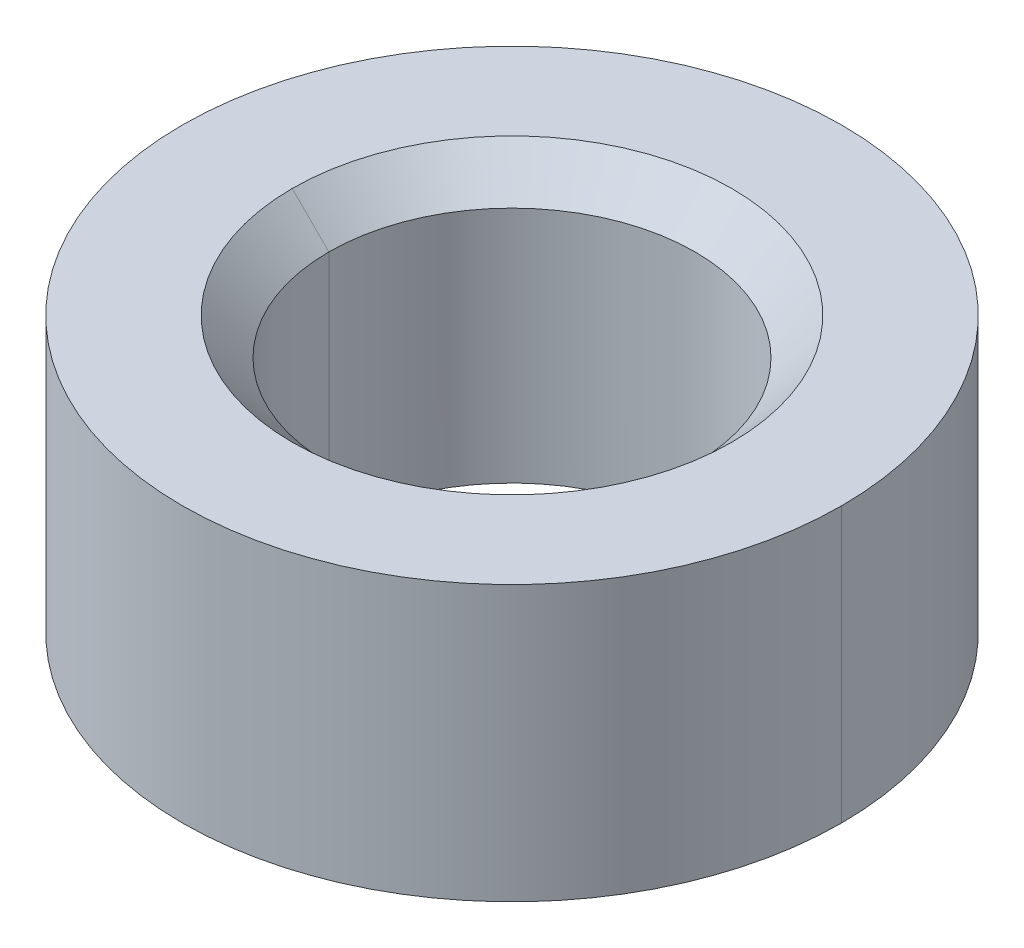
ISO-10303-21;
HEADER;
FILE_DESCRIPTION(('STEP AP214'),'2;1');
FILE_NAME('part.step','',(''),(''),'','','');
FILE_SCHEMA(('AUTOMOTIVE_DESIGN { 1 0 10303 214 1 1 1 1 }'));
ENDSEC;
DATA;
#1=APPLICATION_CONTEXT('core data for automotive mechanical design processes');
#2=APPLICATION_PROTOCOL_DEFINITION('international standard','automotive_design',2000,#1);
#3=PRODUCT_CONTEXT('',#1,'mechanical');
#4=PRODUCT('Part','Part','',(#3));
#5=PRODUCT_RELATED_PRODUCT_CATEGORY('part','',(#4));
#6=PRODUCT_DEFINITION_FORMATION('','',#4);
#7=PRODUCT_DEFINITION_CONTEXT('part definition',#1,'design');
#8=PRODUCT_DEFINITION('design','',#6,#7);
#9=PRODUCT_DEFINITION_SHAPE('','',#8);
#10=(LENGTH_UNIT() NAMED_UNIT(*) SI_UNIT(.MILLI.,.METRE.));
#11=(NAMED_UNIT(*) PLANE_ANGLE_UNIT() SI_UNIT($,.RADIAN.));
#12=(NAMED_UNIT(*) SI_UNIT($,.STERADIAN.) SOLID_ANGLE_UNIT());
#13=UNCERTAINTY_MEASURE_WITH_UNIT(LENGTH_MEASURE(1.E-05),#10,'distance_accuracy_value','');
#14=(GEOMETRIC_REPRESENTATION_CONTEXT(3) GLOBAL_UNCERTAINTY_ASSIGNED_CONTEXT((#13)) GLOBAL_UNIT_ASSIGNED_CONTEXT((#10,
#11,#12)) REPRESENTATION_CONTEXT('',''));
#15=CARTESIAN_POINT('',(0.,0.,0.));
#16=DIRECTION('',(0.,0.,1.));
#17=DIRECTION('',(1.,0.,0.));
#18=AXIS2_PLACEMENT_3D('',#15,#16,#17);
#19=CARTESIAN_POINT('',(0.,0.,0.));
#20=DIRECTION('',(0.,1.,0.));
#21=DIRECTION('',(-1.,0.,0.));
#22=AXIS2_PLACEMENT_3D('',#19,#20,#21);
#23=CYLINDRICAL_SURFACE('',#22,1.);
#24=DIRECTION('',(0.,1.,1.358610737866E-10));
#25=VECTOR('',#24,1.);
#26=CARTESIAN_POINT('',(-1.,-1.5,0.));
#27=LINE('',#26,#25);
#28=CARTESIAN_POINT('',(-1.,-1.5,0.));
#29=VERTEX_POINT('',#28);
#30=CARTESIAN_POINT('',(-1.,-0.1999999999999,0.));
#31=VERTEX_POINT('',#30);
#32=EDGE_CURVE('E141',#29,#31,#27,.T.);
#33=ORIENTED_EDGE('',*,*,#32,.F.);
#34=CARTESIAN_POINT('',(0.,-1.5,0.));
#35=DIRECTION('',(0.,-1.,0.));
#36=DIRECTION('',(-1.,0.,0.));
#37=AXIS2_PLACEMENT_3D('',#34,#35,#36);
#38=CIRCLE('',#37,1.);
#39=CARTESIAN_POINT('',(1.,-1.5,0.));
#40=VERTEX_POINT('',#39);
#41=EDGE_CURVE('E155',#29,#40,#38,.T.);
#42=ORIENTED_EDGE('',*,*,#41,.T.);
#43=DIRECTION('',(0.,1.,-1.166739148025E-10));
#44=VECTOR('',#43,1.);
#45=CARTESIAN_POINT('',(1.,-1.5,-9.97722365513E-11));
#46=LINE('',#45,#44);
#47=CARTESIAN_POINT('',(1.,-0.1999999999999,-1.49658385344E-10));
#48=VERTEX_POINT('',#47);
#49=EDGE_CURVE('E145',#40,#48,#46,.T.);
#50=ORIENTED_EDGE('',*,*,#49,.T.);
#51=CARTESIAN_POINT('',(0.,-0.1999999999999,0.));
#52=DIRECTION('',(0.,1.,0.));
#53=DIRECTION('',(1.,0.,-1.49658385344E-10));
#54=AXIS2_PLACEMENT_3D('',#51,#52,#53);
#55=CIRCLE('',#54,1.);
#56=CARTESIAN_POINT('',(0.,-0.1999999999999,-1.));
#57=VERTEX_POINT('',#56);
#58=EDGE_CURVE('E11',#48,#57,#55,.T.);
#59=ORIENTED_EDGE('',*,*,#58,.T.);
#60=CARTESIAN_POINT('',(0.,-0.1999999999999,0.));
#61=DIRECTION('',(0.,1.,0.));
#62=DIRECTION('',(0.,0.,-1.));
#63=AXIS2_PLACEMENT_3D('',#60,#61,#62);
#64=CIRCLE('',#63,1.);
#65=EDGE_CURVE('E27',#57,#31,#64,.T.);
#66=ORIENTED_EDGE('',*,*,#65,.T.);
#67=EDGE_LOOP('',(#33,#42,#50,#59,#66));
#68=FACE_BOUND('',#67,.T.);
#69=ADVANCED_FACE('F17',(#68),#23,.F.);
#70=CARTESIAN_POINT('',(0.,-0.09999999999995,0.));
#71=DIRECTION('',(0.,1.,0.));
#72=DIRECTION('',(0.,0.,-1.));
#73=AXIS2_PLACEMENT_3D('',#70,#71,#72);
#74=CONICAL_SURFACE('',#73,1.1,0.7853981633973);
#75=DIRECTION('',(-0.707106781186498,0.707106781186598,3.74666534267698E-10));
#76=VECTOR('',#75,1.);
#77=CARTESIAN_POINT('',(-1.,-0.2,1.766192939348E-10));
#78=LINE('',#77,#76);
#79=CARTESIAN_POINT('',(-1.2,0.,0.));
#80=VERTEX_POINT('',#79);
#81=EDGE_CURVE('E111',#31,#80,#78,.T.);
#82=ORIENTED_EDGE('',*,*,#81,.F.);
#83=ORIENTED_EDGE('',*,*,#65,.F.);
#84=ORIENTED_EDGE('',*,*,#58,.F.);
#85=DIRECTION('',(0.707106781186498,0.707106781186598,-1.101046989055E-10));
#86=VECTOR('',#85,1.);
#87=CARTESIAN_POINT('',(1.,-0.2,-2.514483257945E-10));
#88=LINE('',#87,#86);
#89=CARTESIAN_POINT('',(1.2,0.,0.));
#90=VERTEX_POINT('',#89);
#91=EDGE_CURVE('E100',#48,#90,#88,.T.);
#92=ORIENTED_EDGE('',*,*,#91,.T.);
#93=CARTESIAN_POINT('',(0.,0.,0.));
#94=DIRECTION('',(0.,1.,0.));
#95=DIRECTION('',(1.,0.,0.));
#96=AXIS2_PLACEMENT_3D('',#93,#94,#95);
#97=CIRCLE('',#96,1.2);
#98=CARTESIAN_POINT('',(0.,0.,-1.2));
#99=VERTEX_POINT('',#98);
#100=EDGE_CURVE('E105',#90,#99,#97,.T.);
#101=ORIENTED_EDGE('',*,*,#100,.T.);
#102=CARTESIAN_POINT('',(0.,0.,0.));
#103=DIRECTION('',(0.,1.,0.));
#104=DIRECTION('',(0.,0.,-1.));
#105=AXIS2_PLACEMENT_3D('',#102,#103,#104);
#106=CIRCLE('',#105,1.2);
#107=EDGE_CURVE('E119',#99,#80,#106,.T.);
#108=ORIENTED_EDGE('',*,*,#107,.T.);
#109=EDGE_LOOP('',(#82,#83,#84,#92,#101,#108));
#110=FACE_BOUND('',#109,.T.);
#111=ADVANCED_FACE('F103',(#110),#74,.F.);
#112=CARTESIAN_POINT('',(0.,-0.09999999999995,0.));
#113=DIRECTION('',(0.,1.,0.));
#114=DIRECTION('',(0.,0.,-1.));
#115=AXIS2_PLACEMENT_3D('',#112,#113,#114);
#116=CONICAL_SURFACE('',#115,1.1,0.7853981633973);
#117=ORIENTED_EDGE('',*,*,#91,.F.);
#118=CARTESIAN_POINT('',(0.,-0.1999999999999,0.));
#119=DIRECTION('',(0.,1.,0.));
#120=DIRECTION('',(0.,0.,1.));
#121=AXIS2_PLACEMENT_3D('',#118,#119,#120);
#122=CIRCLE('',#121,1.);
#123=CARTESIAN_POINT('',(0.,-0.1999999999999,1.));
#124=VERTEX_POINT('',#123);
#125=EDGE_CURVE('E20',#124,#48,#122,.T.);
#126=ORIENTED_EDGE('',*,*,#125,.F.);
#127=CARTESIAN_POINT('',(0.,-0.1999999999999,0.));
#128=DIRECTION('',(0.,1.,0.));
#129=DIRECTION('',(-1.,0.,0.));
#130=AXIS2_PLACEMENT_3D('',#127,#128,#129);
#131=CIRCLE('',#130,1.);
#132=EDGE_CURVE('E144',#31,#124,#131,.T.);
#133=ORIENTED_EDGE('',*,*,#132,.F.);
#134=ORIENTED_EDGE('',*,*,#81,.T.);
#135=CARTESIAN_POINT('',(0.,0.,0.));
#136=DIRECTION('',(0.,1.,0.));
#137=DIRECTION('',(-1.,0.,0.));
#138=AXIS2_PLACEMENT_3D('',#135,#136,#137);
#139=CIRCLE('',#138,1.2);
#140=CARTESIAN_POINT('',(0.,0.,1.2));
#141=VERTEX_POINT('',#140);
#142=EDGE_CURVE('E123',#80,#141,#139,.T.);
#143=ORIENTED_EDGE('',*,*,#142,.T.);
#144=CARTESIAN_POINT('',(0.,0.,0.));
#145=DIRECTION('',(0.,1.,0.));
#146=DIRECTION('',(0.,0.,1.));
#147=AXIS2_PLACEMENT_3D('',#144,#145,#146);
#148=CIRCLE('',#147,1.2);
#149=EDGE_CURVE('E118',#141,#90,#148,.T.);
#150=ORIENTED_EDGE('',*,*,#149,.T.);
#151=EDGE_LOOP('',(#117,#126,#133,#134,#143,#150));
#152=FACE_BOUND('',#151,.T.);
#153=ADVANCED_FACE('F122',(#152),#116,.F.);
#154=CARTESIAN_POINT('',(0.,0.,0.));
#155=DIRECTION('',(0.,1.,0.));
#156=DIRECTION('',(-1.,0.,0.));
#157=AXIS2_PLACEMENT_3D('',#154,#155,#156);
#158=CYLINDRICAL_SURFACE('',#157,1.);
#159=ORIENTED_EDGE('',*,*,#49,.F.);
#160=CARTESIAN_POINT('',(0.,-1.5,0.));
#161=DIRECTION('',(0.,-1.,0.));
#162=DIRECTION('',(1.,0.,0.));
#163=AXIS2_PLACEMENT_3D('',#160,#161,#162);
#164=CIRCLE('',#163,1.);
#165=EDGE_CURVE('E149',#40,#29,#164,.T.);
#166=ORIENTED_EDGE('',*,*,#165,.T.);
#167=ORIENTED_EDGE('',*,*,#32,.T.);
#168=ORIENTED_EDGE('',*,*,#132,.T.);
#169=ORIENTED_EDGE('',*,*,#125,.T.);
#170=EDGE_LOOP('',(#159,#166,#167,#168,#169));
#171=FACE_BOUND('',#170,.T.);
#172=ADVANCED_FACE('F178',(#171),#158,.F.);
#173=CARTESIAN_POINT('',(0.,-1.5,0.));
#174=DIRECTION('',(0.,-1.,0.));
#175=DIRECTION('',(1.,0.,0.));
#176=AXIS2_PLACEMENT_3D('',#173,#174,#175);
#177=CYLINDRICAL_SURFACE('',#176,1.8);
#178=DIRECTION('',(0.,-1.,0.));
#179=VECTOR('',#178,1.);
#180=CARTESIAN_POINT('',(-1.8,0.,0.));
#181=LINE('',#180,#179);
#182=CARTESIAN_POINT('',(-1.8,0.,0.));
#183=VERTEX_POINT('',#182);
#184=CARTESIAN_POINT('',(-1.8,-1.5,0.));
#185=VERTEX_POINT('',#184);
#186=EDGE_CURVE('E72',#183,#185,#181,.T.);
#187=ORIENTED_EDGE('',*,*,#186,.F.);
#188=CARTESIAN_POINT('',(0.,0.,0.));
#189=DIRECTION('',(0.,-1.,0.));
#190=DIRECTION('',(-1.,0.,0.));
#191=AXIS2_PLACEMENT_3D('',#188,#189,#190);
#192=CIRCLE('',#191,1.8);
#193=CARTESIAN_POINT('',(1.8,0.,0.));
#194=VERTEX_POINT('',#193);
#195=EDGE_CURVE('E133',#183,#194,#192,.T.);
#196=ORIENTED_EDGE('',*,*,#195,.T.);
#197=DIRECTION('',(0.,-1.,0.));
#198=VECTOR('',#197,1.);
#199=CARTESIAN_POINT('',(1.8,0.,0.));
#200=LINE('',#199,#198);
#201=CARTESIAN_POINT('',(1.8,-1.5,0.));
#202=VERTEX_POINT('',#201);
#203=EDGE_CURVE('E84',#194,#202,#200,.T.);
#204=ORIENTED_EDGE('',*,*,#203,.T.);
#205=CARTESIAN_POINT('',(0.,-1.5,0.));
#206=DIRECTION('',(0.,1.,0.));
#207=DIRECTION('',(1.,0.,0.));
#208=AXIS2_PLACEMENT_3D('',#205,#206,#207);
#209=CIRCLE('',#208,1.8);
#210=EDGE_CURVE('E152',#202,#185,#209,.T.);
#211=ORIENTED_EDGE('',*,*,#210,.T.);
#212=EDGE_LOOP('',(#187,#196,#204,#211));
#213=FACE_BOUND('',#212,.T.);
#214=ADVANCED_FACE('F180',(#213),#177,.T.);
#215=CARTESIAN_POINT('',(0.,-1.5,0.));
#216=DIRECTION('',(0.,1.,0.));
#217=DIRECTION('',(1.,0.,0.));
#218=AXIS2_PLACEMENT_3D('',#215,#216,#217);
#219=PLANE('',#218);
#220=ORIENTED_EDGE('',*,*,#41,.F.);
#221=ORIENTED_EDGE('',*,*,#165,.F.);
#222=EDGE_LOOP('',(#220,#221));
#223=FACE_BOUND('',#222,.T.);
#224=ORIENTED_EDGE('',*,*,#210,.F.);
#225=CARTESIAN_POINT('',(0.,-1.5,0.));
#226=DIRECTION('',(0.,1.,0.));
#227=DIRECTION('',(-1.,0.,0.));
#228=AXIS2_PLACEMENT_3D('',#225,#226,#227);
#229=CIRCLE('',#228,1.8);
#230=EDGE_CURVE('E156',#185,#202,#229,.T.);
#231=ORIENTED_EDGE('',*,*,#230,.F.);
#232=EDGE_LOOP('',(#224,#231));
#233=FACE_BOUND('',#232,.T.);
#234=ADVANCED_FACE('F187',(#223,#233),#219,.F.);
#235=CARTESIAN_POINT('',(0.,-1.5,0.));
#236=DIRECTION('',(0.,-1.,0.));
#237=DIRECTION('',(1.,0.,0.));
#238=AXIS2_PLACEMENT_3D('',#235,#236,#237);
#239=CYLINDRICAL_SURFACE('',#238,1.8);
#240=ORIENTED_EDGE('',*,*,#203,.F.);
#241=CARTESIAN_POINT('',(0.,0.,0.));
#242=DIRECTION('',(0.,-1.,0.));
#243=DIRECTION('',(1.,0.,0.));
#244=AXIS2_PLACEMENT_3D('',#241,#242,#243);
#245=CIRCLE('',#244,1.8);
#246=EDGE_CURVE('E125',#194,#183,#245,.T.);
#247=ORIENTED_EDGE('',*,*,#246,.T.);
#248=ORIENTED_EDGE('',*,*,#186,.T.);
#249=ORIENTED_EDGE('',*,*,#230,.T.);
#250=EDGE_LOOP('',(#240,#247,#248,#249));
#251=FACE_BOUND('',#250,.T.);
#252=ADVANCED_FACE('F199',(#251),#239,.T.);
#253=CARTESIAN_POINT('',(0.,0.,0.));
#254=DIRECTION('',(0.,1.,0.));
#255=DIRECTION('',(1.,0.,0.));
#256=AXIS2_PLACEMENT_3D('',#253,#254,#255);
#257=PLANE('',#256);
#258=ORIENTED_EDGE('',*,*,#149,.F.);
#259=ORIENTED_EDGE('',*,*,#142,.F.);
#260=ORIENTED_EDGE('',*,*,#107,.F.);
#261=ORIENTED_EDGE('',*,*,#100,.F.);
#262=EDGE_LOOP('',(#258,#259,#260,#261));
#263=FACE_BOUND('',#262,.T.);
#264=ORIENTED_EDGE('',*,*,#195,.F.);
#265=ORIENTED_EDGE('',*,*,#246,.F.);
#266=EDGE_LOOP('',(#264,#265));
#267=FACE_BOUND('',#266,.T.);
#268=ADVANCED_FACE('F115',(#263,#267),#257,.T.);
#269=CLOSED_SHELL('',(#69,#111,#153,#172,#214,#234,#252,#268));
#270=MANIFOLD_SOLID_BREP('B1',#269);
#271=ADVANCED_BREP_SHAPE_REPRESENTATION('',(#18,#270),#14);
#272=SHAPE_DEFINITION_REPRESENTATION(#9,#271);
ENDSEC;
END-ISO-10303-21;
